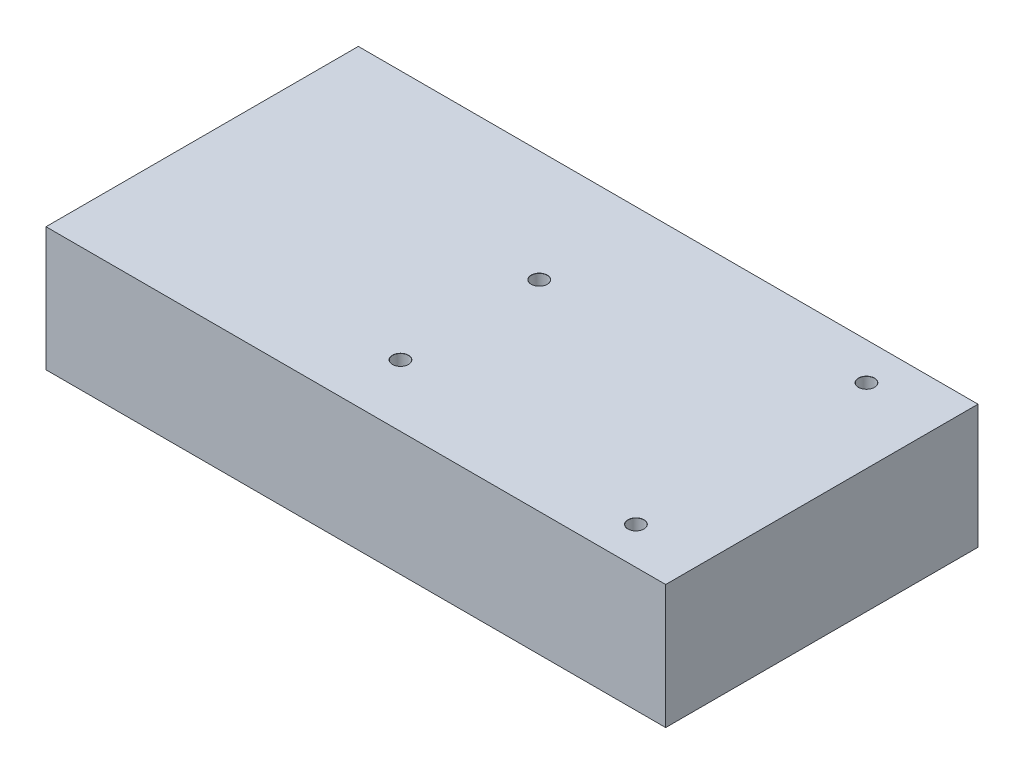
ISO-10303-21;
HEADER;
FILE_DESCRIPTION(('STEP AP214'),'2;1');
FILE_NAME('part.step','',(''),(''),'','','');
FILE_SCHEMA(('AUTOMOTIVE_DESIGN { 1 0 10303 214 1 1 1 1 }'));
ENDSEC;
DATA;
#1=APPLICATION_CONTEXT('core data for automotive mechanical design processes');
#2=APPLICATION_PROTOCOL_DEFINITION('international standard','automotive_design',2000,#1);
#3=PRODUCT_CONTEXT('',#1,'mechanical');
#4=PRODUCT('Part','Part','',(#3));
#5=PRODUCT_RELATED_PRODUCT_CATEGORY('part','',(#4));
#6=PRODUCT_DEFINITION_FORMATION('','',#4);
#7=PRODUCT_DEFINITION_CONTEXT('part definition',#1,'design');
#8=PRODUCT_DEFINITION('design','',#6,#7);
#9=PRODUCT_DEFINITION_SHAPE('','',#8);
#10=(LENGTH_UNIT() NAMED_UNIT(*) SI_UNIT(.MILLI.,.METRE.));
#11=(NAMED_UNIT(*) PLANE_ANGLE_UNIT() SI_UNIT($,.RADIAN.));
#12=(NAMED_UNIT(*) SI_UNIT($,.STERADIAN.) SOLID_ANGLE_UNIT());
#13=UNCERTAINTY_MEASURE_WITH_UNIT(LENGTH_MEASURE(1.E-05),#10,'distance_accuracy_value','');
#14=(GEOMETRIC_REPRESENTATION_CONTEXT(3) GLOBAL_UNCERTAINTY_ASSIGNED_CONTEXT((#13)) GLOBAL_UNIT_ASSIGNED_CONTEXT((#10,
#11,#12)) REPRESENTATION_CONTEXT('',''));
#15=CARTESIAN_POINT('',(0.,0.,0.));
#16=DIRECTION('',(0.,0.,1.));
#17=DIRECTION('',(1.,0.,0.));
#18=AXIS2_PLACEMENT_3D('',#15,#16,#17);
#19=CARTESIAN_POINT('',(-62.5,25.,-31.5));
#20=DIRECTION('',(0.,0.,-1.));
#21=DIRECTION('',(-1.,0.,0.));
#22=AXIS2_PLACEMENT_3D('',#19,#20,#21);
#23=PLANE('',#22);
#24=DIRECTION('',(1.,0.,0.));
#25=VECTOR('',#24,1.);
#26=CARTESIAN_POINT('',(-62.5,0.,-31.5));
#27=LINE('',#26,#25);
#28=CARTESIAN_POINT('',(-62.5,0.,-31.5));
#29=VERTEX_POINT('',#28);
#30=CARTESIAN_POINT('',(62.5,0.,-31.5));
#31=VERTEX_POINT('',#30);
#32=EDGE_CURVE('E110',#29,#31,#27,.T.);
#33=ORIENTED_EDGE('',*,*,#32,.F.);
#34=DIRECTION('',(0.,-1.,0.));
#35=VECTOR('',#34,1.);
#36=CARTESIAN_POINT('',(-62.5,25.,-31.5));
#37=LINE('',#36,#35);
#38=CARTESIAN_POINT('',(-62.5,25.,-31.5));
#39=VERTEX_POINT('',#38);
#40=EDGE_CURVE('E11',#39,#29,#37,.T.);
#41=ORIENTED_EDGE('',*,*,#40,.F.);
#42=DIRECTION('',(1.,0.,0.));
#43=VECTOR('',#42,1.);
#44=CARTESIAN_POINT('',(-62.5,25.,-31.5));
#45=LINE('',#44,#43);
#46=CARTESIAN_POINT('',(62.5,25.,-31.5));
#47=VERTEX_POINT('',#46);
#48=EDGE_CURVE('E101',#39,#47,#45,.T.);
#49=ORIENTED_EDGE('',*,*,#48,.T.);
#50=DIRECTION('',(0.,-1.,0.));
#51=VECTOR('',#50,1.);
#52=CARTESIAN_POINT('',(62.5,25.,-31.5));
#53=LINE('',#52,#51);
#54=EDGE_CURVE('E42',#47,#31,#53,.T.);
#55=ORIENTED_EDGE('',*,*,#54,.T.);
#56=EDGE_LOOP('',(#33,#41,#49,#55));
#57=FACE_BOUND('',#56,.T.);
#58=ADVANCED_FACE('F39',(#57),#23,.T.);
#59=CARTESIAN_POINT('',(-62.5,25.,31.5));
#60=DIRECTION('',(-1.,0.,0.));
#61=DIRECTION('',(0.,0.,1.));
#62=AXIS2_PLACEMENT_3D('',#59,#60,#61);
#63=PLANE('',#62);
#64=DIRECTION('',(0.,0.,-1.));
#65=VECTOR('',#64,1.);
#66=CARTESIAN_POINT('',(-62.5,0.,31.5));
#67=LINE('',#66,#65);
#68=CARTESIAN_POINT('',(-62.5,0.,31.5));
#69=VERTEX_POINT('',#68);
#70=EDGE_CURVE('E104',#69,#29,#67,.T.);
#71=ORIENTED_EDGE('',*,*,#70,.F.);
#72=DIRECTION('',(0.,-1.,0.));
#73=VECTOR('',#72,1.);
#74=CARTESIAN_POINT('',(-62.5,25.,31.5));
#75=LINE('',#74,#73);
#76=CARTESIAN_POINT('',(-62.5,25.,31.5));
#77=VERTEX_POINT('',#76);
#78=EDGE_CURVE('E49',#77,#69,#75,.T.);
#79=ORIENTED_EDGE('',*,*,#78,.F.);
#80=DIRECTION('',(0.,0.,-1.));
#81=VECTOR('',#80,1.);
#82=CARTESIAN_POINT('',(-62.5,25.,31.5));
#83=LINE('',#82,#81);
#84=EDGE_CURVE('E88',#77,#39,#83,.T.);
#85=ORIENTED_EDGE('',*,*,#84,.T.);
#86=ORIENTED_EDGE('',*,*,#40,.T.);
#87=EDGE_LOOP('',(#71,#79,#85,#86));
#88=FACE_BOUND('',#87,.T.);
#89=ADVANCED_FACE('F127',(#88),#63,.T.);
#90=CARTESIAN_POINT('',(-62.5,25.,31.5));
#91=DIRECTION('',(0.,0.,-1.));
#92=DIRECTION('',(-1.,0.,0.));
#93=AXIS2_PLACEMENT_3D('',#90,#91,#92);
#94=PLANE('',#93);
#95=DIRECTION('',(1.,0.,0.));
#96=VECTOR('',#95,1.);
#97=CARTESIAN_POINT('',(-62.5,0.,31.5));
#98=LINE('',#97,#96);
#99=CARTESIAN_POINT('',(62.5,0.,31.5));
#100=VERTEX_POINT('',#99);
#101=EDGE_CURVE('E94',#69,#100,#98,.T.);
#102=ORIENTED_EDGE('',*,*,#101,.T.);
#103=DIRECTION('',(0.,-1.,0.));
#104=VECTOR('',#103,1.);
#105=CARTESIAN_POINT('',(62.5,25.,31.5));
#106=LINE('',#105,#104);
#107=CARTESIAN_POINT('',(62.5,25.,31.5));
#108=VERTEX_POINT('',#107);
#109=EDGE_CURVE('E92',#108,#100,#106,.T.);
#110=ORIENTED_EDGE('',*,*,#109,.F.);
#111=DIRECTION('',(1.,0.,0.));
#112=VECTOR('',#111,1.);
#113=CARTESIAN_POINT('',(-62.5,25.,31.5));
#114=LINE('',#113,#112);
#115=EDGE_CURVE('E85',#77,#108,#114,.T.);
#116=ORIENTED_EDGE('',*,*,#115,.F.);
#117=ORIENTED_EDGE('',*,*,#78,.T.);
#118=EDGE_LOOP('',(#102,#110,#116,#117));
#119=FACE_BOUND('',#118,.T.);
#120=ADVANCED_FACE('F93',(#119),#94,.F.);
#121=CARTESIAN_POINT('',(62.5,25.,31.5));
#122=DIRECTION('',(-1.,0.,0.));
#123=DIRECTION('',(0.,0.,1.));
#124=AXIS2_PLACEMENT_3D('',#121,#122,#123);
#125=PLANE('',#124);
#126=DIRECTION('',(0.,0.,-1.));
#127=VECTOR('',#126,1.);
#128=CARTESIAN_POINT('',(62.5,0.,31.5));
#129=LINE('',#128,#127);
#130=EDGE_CURVE('E114',#100,#31,#129,.T.);
#131=ORIENTED_EDGE('',*,*,#130,.T.);
#132=ORIENTED_EDGE('',*,*,#54,.F.);
#133=DIRECTION('',(0.,0.,-1.));
#134=VECTOR('',#133,1.);
#135=CARTESIAN_POINT('',(62.5,25.,31.5));
#136=LINE('',#135,#134);
#137=EDGE_CURVE('E82',#108,#47,#136,.T.);
#138=ORIENTED_EDGE('',*,*,#137,.F.);
#139=ORIENTED_EDGE('',*,*,#109,.T.);
#140=EDGE_LOOP('',(#131,#132,#138,#139));
#141=FACE_BOUND('',#140,.T.);
#142=ADVANCED_FACE('F99',(#141),#125,.F.);
#143=CARTESIAN_POINT('',(0.,25.,0.));
#144=DIRECTION('',(0.,1.,0.));
#145=DIRECTION('',(0.,0.,1.));
#146=AXIS2_PLACEMENT_3D('',#143,#144,#145);
#147=PLANE('',#146);
#148=CARTESIAN_POINT('',(47.5,25.,-24.));
#149=DIRECTION('',(0.,1.,0.));
#150=DIRECTION('',(0.,0.,1.));
#151=AXIS2_PLACEMENT_3D('',#148,#149,#150);
#152=CIRCLE('',#151,1.625);
#153=CARTESIAN_POINT('',(47.5,25.,-22.375));
#154=VERTEX_POINT('',#153);
#155=EDGE_CURVE('E187',#154,#154,#152,.T.);
#156=ORIENTED_EDGE('',*,*,#155,.F.);
#157=EDGE_LOOP('',(#156));
#158=FACE_BOUND('',#157,.T.);
#159=CARTESIAN_POINT('',(49.,25.,24.));
#160=DIRECTION('',(0.,1.,0.));
#161=DIRECTION('',(0.,0.,1.));
#162=AXIS2_PLACEMENT_3D('',#159,#160,#161);
#163=CIRCLE('',#162,1.625);
#164=CARTESIAN_POINT('',(49.,25.,25.625));
#165=VERTEX_POINT('',#164);
#166=EDGE_CURVE('E197',#165,#165,#163,.T.);
#167=ORIENTED_EDGE('',*,*,#166,.F.);
#168=EDGE_LOOP('',(#167));
#169=FACE_BOUND('',#168,.T.);
#170=CARTESIAN_POINT('',(-3.5,25.,-9.));
#171=DIRECTION('',(0.,1.,0.));
#172=DIRECTION('',(0.,0.,1.));
#173=AXIS2_PLACEMENT_3D('',#170,#171,#172);
#174=CIRCLE('',#173,1.625);
#175=CARTESIAN_POINT('',(-3.5,25.,-7.375));
#176=VERTEX_POINT('',#175);
#177=EDGE_CURVE('E209',#176,#176,#174,.T.);
#178=ORIENTED_EDGE('',*,*,#177,.F.);
#179=EDGE_LOOP('',(#178));
#180=FACE_BOUND('',#179,.T.);
#181=CARTESIAN_POINT('',(-3.5,25.,19.));
#182=DIRECTION('',(0.,1.,0.));
#183=DIRECTION('',(0.,0.,1.));
#184=AXIS2_PLACEMENT_3D('',#181,#182,#183);
#185=CIRCLE('',#184,1.625);
#186=CARTESIAN_POINT('',(-3.5,25.,20.625));
#187=VERTEX_POINT('',#186);
#188=EDGE_CURVE('E221',#187,#187,#185,.T.);
#189=ORIENTED_EDGE('',*,*,#188,.F.);
#190=EDGE_LOOP('',(#189));
#191=FACE_BOUND('',#190,.T.);
#192=ORIENTED_EDGE('',*,*,#48,.F.);
#193=ORIENTED_EDGE('',*,*,#84,.F.);
#194=ORIENTED_EDGE('',*,*,#115,.T.);
#195=ORIENTED_EDGE('',*,*,#137,.T.);
#196=EDGE_LOOP('',(#192,#193,#194,#195));
#197=FACE_BOUND('',#196,.T.);
#198=ADVANCED_FACE('F87',(#158,#169,#180,#191,#197),#147,.T.);
#199=CARTESIAN_POINT('',(0.,0.,0.));
#200=DIRECTION('',(0.,1.,0.));
#201=DIRECTION('',(0.,0.,1.));
#202=AXIS2_PLACEMENT_3D('',#199,#200,#201);
#203=PLANE('',#202);
#204=CARTESIAN_POINT('',(47.5,0.,-24.));
#205=DIRECTION('',(0.,1.,0.));
#206=DIRECTION('',(0.,0.,1.));
#207=AXIS2_PLACEMENT_3D('',#204,#205,#206);
#208=CIRCLE('',#207,1.59999999999999);
#209=CARTESIAN_POINT('',(47.5,0.,-22.4));
#210=VERTEX_POINT('',#209);
#211=EDGE_CURVE('E191',#210,#210,#208,.T.);
#212=ORIENTED_EDGE('',*,*,#211,.T.);
#213=EDGE_LOOP('',(#212));
#214=FACE_BOUND('',#213,.T.);
#215=CARTESIAN_POINT('',(49.,0.,24.));
#216=DIRECTION('',(0.,1.,0.));
#217=DIRECTION('',(0.,0.,1.));
#218=AXIS2_PLACEMENT_3D('',#215,#216,#217);
#219=CIRCLE('',#218,1.59999999999999);
#220=CARTESIAN_POINT('',(49.,0.,25.6));
#221=VERTEX_POINT('',#220);
#222=EDGE_CURVE('E205',#221,#221,#219,.T.);
#223=ORIENTED_EDGE('',*,*,#222,.T.);
#224=EDGE_LOOP('',(#223));
#225=FACE_BOUND('',#224,.T.);
#226=CARTESIAN_POINT('',(-3.5,0.,-9.));
#227=DIRECTION('',(0.,1.,0.));
#228=DIRECTION('',(0.,0.,1.));
#229=AXIS2_PLACEMENT_3D('',#226,#227,#228);
#230=CIRCLE('',#229,1.59999999999999);
#231=CARTESIAN_POINT('',(-3.5,0.,-7.40000000000001));
#232=VERTEX_POINT('',#231);
#233=EDGE_CURVE('E217',#232,#232,#230,.T.);
#234=ORIENTED_EDGE('',*,*,#233,.T.);
#235=EDGE_LOOP('',(#234));
#236=FACE_BOUND('',#235,.T.);
#237=CARTESIAN_POINT('',(-3.5,0.,19.));
#238=DIRECTION('',(0.,1.,0.));
#239=DIRECTION('',(0.,0.,1.));
#240=AXIS2_PLACEMENT_3D('',#237,#238,#239);
#241=CIRCLE('',#240,1.59999999999999);
#242=CARTESIAN_POINT('',(-3.5,0.,20.6));
#243=VERTEX_POINT('',#242);
#244=EDGE_CURVE('E115',#243,#243,#241,.T.);
#245=ORIENTED_EDGE('',*,*,#244,.T.);
#246=EDGE_LOOP('',(#245));
#247=FACE_BOUND('',#246,.T.);
#248=ORIENTED_EDGE('',*,*,#32,.T.);
#249=ORIENTED_EDGE('',*,*,#130,.F.);
#250=ORIENTED_EDGE('',*,*,#101,.F.);
#251=ORIENTED_EDGE('',*,*,#70,.T.);
#252=EDGE_LOOP('',(#248,#249,#250,#251));
#253=FACE_BOUND('',#252,.T.);
#254=ADVANCED_FACE('F126',(#214,#225,#236,#247,#253),#203,.F.);
#255=CARTESIAN_POINT('',(-3.5,25.,19.));
#256=DIRECTION('',(0.,1.,0.));
#257=DIRECTION('',(0.,0.,1.));
#258=AXIS2_PLACEMENT_3D('',#255,#256,#257);
#259=CYLINDRICAL_SURFACE('',#258,1.6);
#260=ORIENTED_EDGE('',*,*,#244,.F.);
#261=EDGE_LOOP('',(#260));
#262=FACE_BOUND('',#261,.T.);
#263=CARTESIAN_POINT('',(-3.5,24.975,19.));
#264=DIRECTION('',(0.,1.,0.));
#265=DIRECTION('',(0.,0.,1.));
#266=AXIS2_PLACEMENT_3D('',#263,#264,#265);
#267=CIRCLE('',#266,1.6);
#268=CARTESIAN_POINT('',(-3.5,24.975,20.6));
#269=VERTEX_POINT('',#268);
#270=EDGE_CURVE('E225',#269,#269,#267,.T.);
#271=ORIENTED_EDGE('',*,*,#270,.T.);
#272=EDGE_LOOP('',(#271));
#273=FACE_BOUND('',#272,.T.);
#274=ADVANCED_FACE('F145',(#262,#273),#259,.F.);
#275=CARTESIAN_POINT('',(-3.5,25.,19.));
#276=DIRECTION('',(0.,1.,0.));
#277=DIRECTION('',(0.,0.,1.));
#278=AXIS2_PLACEMENT_3D('',#275,#276,#277);
#279=CONICAL_SURFACE('',#278,1.625,0.785398163397357);
#280=ORIENTED_EDGE('',*,*,#270,.F.);
#281=EDGE_LOOP('',(#280));
#282=FACE_BOUND('',#281,.T.);
#283=ORIENTED_EDGE('',*,*,#188,.T.);
#284=EDGE_LOOP('',(#283));
#285=FACE_BOUND('',#284,.T.);
#286=ADVANCED_FACE('F152',(#282,#285),#279,.F.);
#287=CARTESIAN_POINT('',(-3.5,25.,-9.));
#288=DIRECTION('',(0.,1.,0.));
#289=DIRECTION('',(0.,0.,1.));
#290=AXIS2_PLACEMENT_3D('',#287,#288,#289);
#291=CYLINDRICAL_SURFACE('',#290,1.6);
#292=ORIENTED_EDGE('',*,*,#233,.F.);
#293=EDGE_LOOP('',(#292));
#294=FACE_BOUND('',#293,.T.);
#295=CARTESIAN_POINT('',(-3.5,24.975,-9.));
#296=DIRECTION('',(0.,1.,0.));
#297=DIRECTION('',(0.,0.,1.));
#298=AXIS2_PLACEMENT_3D('',#295,#296,#297);
#299=CIRCLE('',#298,1.6);
#300=CARTESIAN_POINT('',(-3.5,24.975,-7.4));
#301=VERTEX_POINT('',#300);
#302=EDGE_CURVE('E213',#301,#301,#299,.T.);
#303=ORIENTED_EDGE('',*,*,#302,.T.);
#304=EDGE_LOOP('',(#303));
#305=FACE_BOUND('',#304,.T.);
#306=ADVANCED_FACE('F156',(#294,#305),#291,.F.);
#307=CARTESIAN_POINT('',(-3.5,25.,-9.));
#308=DIRECTION('',(0.,1.,0.));
#309=DIRECTION('',(0.,0.,1.));
#310=AXIS2_PLACEMENT_3D('',#307,#308,#309);
#311=CONICAL_SURFACE('',#310,1.625,0.785398163397357);
#312=ORIENTED_EDGE('',*,*,#302,.F.);
#313=EDGE_LOOP('',(#312));
#314=FACE_BOUND('',#313,.T.);
#315=ORIENTED_EDGE('',*,*,#177,.T.);
#316=EDGE_LOOP('',(#315));
#317=FACE_BOUND('',#316,.T.);
#318=ADVANCED_FACE('F160',(#314,#317),#311,.F.);
#319=CARTESIAN_POINT('',(49.,25.,24.));
#320=DIRECTION('',(0.,1.,0.));
#321=DIRECTION('',(0.,0.,1.));
#322=AXIS2_PLACEMENT_3D('',#319,#320,#321);
#323=CYLINDRICAL_SURFACE('',#322,1.59999999999999);
#324=ORIENTED_EDGE('',*,*,#222,.F.);
#325=EDGE_LOOP('',(#324));
#326=FACE_BOUND('',#325,.T.);
#327=CARTESIAN_POINT('',(49.,24.975,24.));
#328=DIRECTION('',(0.,1.,0.));
#329=DIRECTION('',(0.,0.,1.));
#330=AXIS2_PLACEMENT_3D('',#327,#328,#329);
#331=CIRCLE('',#330,1.6);
#332=CARTESIAN_POINT('',(49.,24.975,25.6));
#333=VERTEX_POINT('',#332);
#334=EDGE_CURVE('E201',#333,#333,#331,.T.);
#335=ORIENTED_EDGE('',*,*,#334,.T.);
#336=EDGE_LOOP('',(#335));
#337=FACE_BOUND('',#336,.T.);
#338=ADVANCED_FACE('F164',(#326,#337),#323,.F.);
#339=CARTESIAN_POINT('',(49.,25.,24.));
#340=DIRECTION('',(0.,1.,0.));
#341=DIRECTION('',(0.,0.,1.));
#342=AXIS2_PLACEMENT_3D('',#339,#340,#341);
#343=CONICAL_SURFACE('',#342,1.625,0.785398163397379);
#344=ORIENTED_EDGE('',*,*,#334,.F.);
#345=EDGE_LOOP('',(#344));
#346=FACE_BOUND('',#345,.T.);
#347=ORIENTED_EDGE('',*,*,#166,.T.);
#348=EDGE_LOOP('',(#347));
#349=FACE_BOUND('',#348,.T.);
#350=ADVANCED_FACE('F168',(#346,#349),#343,.F.);
#351=CARTESIAN_POINT('',(47.5,25.,-24.));
#352=DIRECTION('',(0.,1.,0.));
#353=DIRECTION('',(0.,0.,1.));
#354=AXIS2_PLACEMENT_3D('',#351,#352,#353);
#355=CYLINDRICAL_SURFACE('',#354,1.59999999999999);
#356=ORIENTED_EDGE('',*,*,#211,.F.);
#357=EDGE_LOOP('',(#356));
#358=FACE_BOUND('',#357,.T.);
#359=CARTESIAN_POINT('',(47.5,24.975,-24.));
#360=DIRECTION('',(0.,1.,0.));
#361=DIRECTION('',(0.,0.,1.));
#362=AXIS2_PLACEMENT_3D('',#359,#360,#361);
#363=CIRCLE('',#362,1.6);
#364=CARTESIAN_POINT('',(47.5,24.975,-22.4));
#365=VERTEX_POINT('',#364);
#366=EDGE_CURVE('E185',#365,#365,#363,.T.);
#367=ORIENTED_EDGE('',*,*,#366,.T.);
#368=EDGE_LOOP('',(#367));
#369=FACE_BOUND('',#368,.T.);
#370=ADVANCED_FACE('F172',(#358,#369),#355,.F.);
#371=CARTESIAN_POINT('',(47.5,25.,-24.));
#372=DIRECTION('',(0.,1.,0.));
#373=DIRECTION('',(0.,0.,1.));
#374=AXIS2_PLACEMENT_3D('',#371,#372,#373);
#375=CONICAL_SURFACE('',#374,1.625,0.785398163397379);
#376=ORIENTED_EDGE('',*,*,#366,.F.);
#377=EDGE_LOOP('',(#376));
#378=FACE_BOUND('',#377,.T.);
#379=ORIENTED_EDGE('',*,*,#155,.T.);
#380=EDGE_LOOP('',(#379));
#381=FACE_BOUND('',#380,.T.);
#382=ADVANCED_FACE('F176',(#378,#381),#375,.F.);
#383=CLOSED_SHELL('',(#58,#89,#120,#142,#198,#254,#274,#286,#306,#318,#338,#350,#370,#382));
#384=MANIFOLD_SOLID_BREP('B2',#383);
#385=ADVANCED_BREP_SHAPE_REPRESENTATION('',(#18,#384),#14);
#386=SHAPE_DEFINITION_REPRESENTATION(#9,#385);
ENDSEC;
END-ISO-10303-21;
